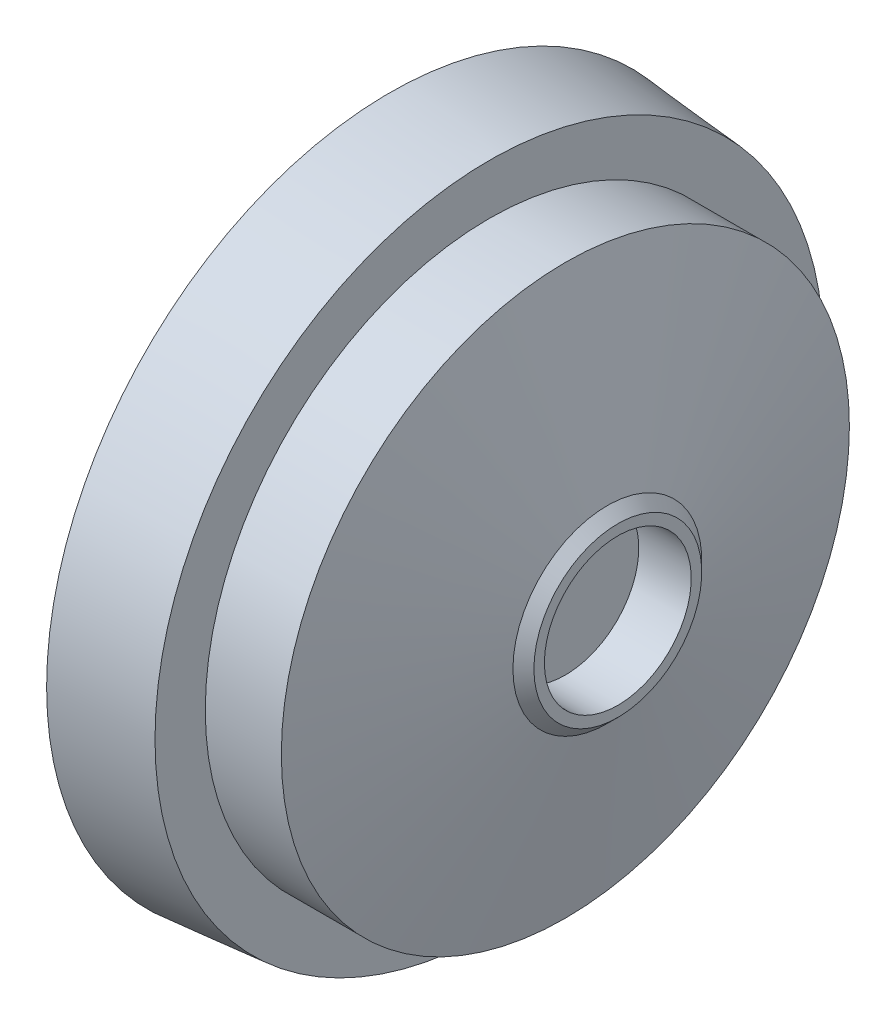
ISO-10303-21;
HEADER;
FILE_DESCRIPTION(('STEP AP214'),'2;1');
FILE_NAME('part.step','',(''),(''),'','','');
FILE_SCHEMA(('AUTOMOTIVE_DESIGN { 1 0 10303 214 1 1 1 1 }'));
ENDSEC;
DATA;
#1=APPLICATION_CONTEXT('core data for automotive mechanical design processes');
#2=APPLICATION_PROTOCOL_DEFINITION('international standard','automotive_design',2000,#1);
#3=PRODUCT_CONTEXT('',#1,'mechanical');
#4=PRODUCT('Part','Part','',(#3));
#5=PRODUCT_RELATED_PRODUCT_CATEGORY('part','',(#4));
#6=PRODUCT_DEFINITION_FORMATION('','',#4);
#7=PRODUCT_DEFINITION_CONTEXT('part definition',#1,'design');
#8=PRODUCT_DEFINITION('design','',#6,#7);
#9=PRODUCT_DEFINITION_SHAPE('','',#8);
#10=(LENGTH_UNIT() NAMED_UNIT(*) SI_UNIT(.MILLI.,.METRE.));
#11=(NAMED_UNIT(*) PLANE_ANGLE_UNIT() SI_UNIT($,.RADIAN.));
#12=(NAMED_UNIT(*) SI_UNIT($,.STERADIAN.) SOLID_ANGLE_UNIT());
#13=UNCERTAINTY_MEASURE_WITH_UNIT(LENGTH_MEASURE(1.E-05),#10,'distance_accuracy_value','');
#14=(GEOMETRIC_REPRESENTATION_CONTEXT(3) GLOBAL_UNCERTAINTY_ASSIGNED_CONTEXT((#13)) GLOBAL_UNIT_ASSIGNED_CONTEXT((#10,
#11,#12)) REPRESENTATION_CONTEXT('',''));
#15=CARTESIAN_POINT('',(0.,0.,0.));
#16=DIRECTION('',(0.,0.,1.));
#17=DIRECTION('',(1.,0.,0.));
#18=AXIS2_PLACEMENT_3D('',#15,#16,#17);
#19=CARTESIAN_POINT('',(-1.6,0.,0.));
#20=DIRECTION('',(1.,0.,0.));
#21=DIRECTION('',(0.,0.,-1.));
#22=AXIS2_PLACEMENT_3D('',#19,#20,#21);
#23=PLANE('',#22);
#24=CARTESIAN_POINT('',(-1.6,0.,0.));
#25=DIRECTION('',(1.,0.,0.));
#26=DIRECTION('',(0.,0.,-1.));
#27=AXIS2_PLACEMENT_3D('',#24,#25,#26);
#28=CIRCLE('',#27,50.6);
#29=CARTESIAN_POINT('',(-1.6,0.,-50.6));
#30=VERTEX_POINT('',#29);
#31=EDGE_CURVE('E39',#30,#30,#28,.F.);
#32=ORIENTED_EDGE('',*,*,#31,.T.);
#33=EDGE_LOOP('',(#32));
#34=FACE_BOUND('',#33,.T.);
#35=ADVANCED_FACE('F32',(#34),#23,.F.);
#36=CARTESIAN_POINT('',(0.,0.,0.));
#37=DIRECTION('',(-1.,0.,0.));
#38=DIRECTION('',(0.,0.,1.));
#39=AXIS2_PLACEMENT_3D('',#36,#37,#38);
#40=CYLINDRICAL_SURFACE('',#39,53.6);
#41=CARTESIAN_POINT('',(1.4,0.,0.));
#42=DIRECTION('',(1.,0.,0.));
#43=DIRECTION('',(0.,0.,-1.));
#44=AXIS2_PLACEMENT_3D('',#41,#42,#43);
#45=CIRCLE('',#44,53.6);
#46=CARTESIAN_POINT('',(1.4,0.,-53.6));
#47=VERTEX_POINT('',#46);
#48=EDGE_CURVE('E10',#47,#47,#45,.T.);
#49=ORIENTED_EDGE('',*,*,#48,.T.);
#50=EDGE_LOOP('',(#49));
#51=FACE_BOUND('',#50,.T.);
#52=CARTESIAN_POINT('',(10.4,0.,0.));
#53=DIRECTION('',(-1.,0.,0.));
#54=DIRECTION('',(0.,0.,1.));
#55=AXIS2_PLACEMENT_3D('',#52,#53,#54);
#56=CIRCLE('',#55,53.6);
#57=CARTESIAN_POINT('',(10.4,0.,53.6));
#58=VERTEX_POINT('',#57);
#59=EDGE_CURVE('E43',#58,#58,#56,.T.);
#60=ORIENTED_EDGE('',*,*,#59,.T.);
#61=EDGE_LOOP('',(#60));
#62=FACE_BOUND('',#61,.T.);
#63=ADVANCED_FACE('F94',(#51,#62),#40,.T.);
#64=CARTESIAN_POINT('',(10.4,53.6,0.));
#65=DIRECTION('',(1.,0.,0.));
#66=DIRECTION('',(0.,0.,-1.));
#67=AXIS2_PLACEMENT_3D('',#64,#65,#66);
#68=PLANE('',#67);
#69=ORIENTED_EDGE('',*,*,#59,.F.);
#70=EDGE_LOOP('',(#69));
#71=FACE_BOUND('',#70,.T.);
#72=CARTESIAN_POINT('',(10.4,0.,0.));
#73=DIRECTION('',(-1.,0.,0.));
#74=DIRECTION('',(0.,0.,1.));
#75=AXIS2_PLACEMENT_3D('',#72,#73,#74);
#76=CIRCLE('',#75,60.9);
#77=CARTESIAN_POINT('',(10.4,0.,60.9));
#78=VERTEX_POINT('',#77);
#79=EDGE_CURVE('E47',#78,#78,#76,.T.);
#80=ORIENTED_EDGE('',*,*,#79,.T.);
#81=EDGE_LOOP('',(#80));
#82=FACE_BOUND('',#81,.T.);
#83=ADVANCED_FACE('F98',(#71,#82),#68,.F.);
#84=CARTESIAN_POINT('',(0.,0.,0.));
#85=DIRECTION('',(-1.,0.,0.));
#86=DIRECTION('',(0.,0.,1.));
#87=AXIS2_PLACEMENT_3D('',#84,#85,#86);
#88=CYLINDRICAL_SURFACE('',#87,60.9);
#89=ORIENTED_EDGE('',*,*,#79,.F.);
#90=EDGE_LOOP('',(#89));
#91=FACE_BOUND('',#90,.T.);
#92=CARTESIAN_POINT('',(0.,0.,0.));
#93=DIRECTION('',(-1.,0.,0.));
#94=DIRECTION('',(0.,0.,1.));
#95=AXIS2_PLACEMENT_3D('',#92,#93,#94);
#96=CIRCLE('',#95,60.9);
#97=CARTESIAN_POINT('',(0.,0.,60.9));
#98=VERTEX_POINT('',#97);
#99=EDGE_CURVE('E52',#98,#98,#96,.T.);
#100=ORIENTED_EDGE('',*,*,#99,.T.);
#101=EDGE_LOOP('',(#100));
#102=FACE_BOUND('',#101,.T.);
#103=ADVANCED_FACE('F103',(#91,#102),#88,.F.);
#104=CARTESIAN_POINT('',(0.,60.9,0.));
#105=DIRECTION('',(1.,0.,0.));
#106=DIRECTION('',(0.,0.,-1.));
#107=AXIS2_PLACEMENT_3D('',#104,#105,#106);
#108=PLANE('',#107);
#109=ORIENTED_EDGE('',*,*,#99,.F.);
#110=EDGE_LOOP('',(#109));
#111=FACE_BOUND('',#110,.T.);
#112=CARTESIAN_POINT('',(0.,0.,0.));
#113=DIRECTION('',(-1.,0.,0.));
#114=DIRECTION('',(0.,0.,1.));
#115=AXIS2_PLACEMENT_3D('',#112,#113,#114);
#116=CIRCLE('',#115,65.4);
#117=CARTESIAN_POINT('',(0.,0.,65.4));
#118=VERTEX_POINT('',#117);
#119=EDGE_CURVE('E55',#118,#118,#116,.T.);
#120=ORIENTED_EDGE('',*,*,#119,.T.);
#121=EDGE_LOOP('',(#120));
#122=FACE_BOUND('',#121,.T.);
#123=ADVANCED_FACE('F107',(#111,#122),#108,.F.);
#124=CARTESIAN_POINT('',(19.,0.,0.));
#125=DIRECTION('',(-1.,0.,0.));
#126=DIRECTION('',(0.,0.,1.));
#127=AXIS2_PLACEMENT_3D('',#124,#125,#126);
#128=CONICAL_SURFACE('',#127,63.7377153930075,0.0872664625997127);
#129=ORIENTED_EDGE('',*,*,#119,.F.);
#130=EDGE_LOOP('',(#129));
#131=FACE_BOUND('',#130,.T.);
#132=CARTESIAN_POINT('',(19.,0.,0.));
#133=DIRECTION('',(-1.,0.,0.));
#134=DIRECTION('',(0.,0.,1.));
#135=AXIS2_PLACEMENT_3D('',#132,#133,#134);
#136=CIRCLE('',#135,63.7377153930075);
#137=CARTESIAN_POINT('',(19.,0.,63.7377153930075));
#138=VERTEX_POINT('',#137);
#139=EDGE_CURVE('E58',#138,#138,#136,.T.);
#140=ORIENTED_EDGE('',*,*,#139,.T.);
#141=EDGE_LOOP('',(#140));
#142=FACE_BOUND('',#141,.T.);
#143=ADVANCED_FACE('F111',(#131,#142),#128,.T.);
#144=CARTESIAN_POINT('',(19.,63.7377153930075,0.));
#145=DIRECTION('',(-1.,0.,0.));
#146=DIRECTION('',(0.,0.,1.));
#147=AXIS2_PLACEMENT_3D('',#144,#145,#146);
#148=PLANE('',#147);
#149=ORIENTED_EDGE('',*,*,#139,.F.);
#150=EDGE_LOOP('',(#149));
#151=FACE_BOUND('',#150,.T.);
#152=CARTESIAN_POINT('',(19.,0.,0.));
#153=DIRECTION('',(-1.,0.,0.));
#154=DIRECTION('',(0.,0.,1.));
#155=AXIS2_PLACEMENT_3D('',#152,#153,#154);
#156=CIRCLE('',#155,54.15);
#157=CARTESIAN_POINT('',(19.,0.,54.15));
#158=VERTEX_POINT('',#157);
#159=EDGE_CURVE('E61',#158,#158,#156,.T.);
#160=ORIENTED_EDGE('',*,*,#159,.T.);
#161=EDGE_LOOP('',(#160));
#162=FACE_BOUND('',#161,.T.);
#163=ADVANCED_FACE('F115',(#151,#162),#148,.F.);
#164=CARTESIAN_POINT('',(0.,0.,0.));
#165=DIRECTION('',(-1.,0.,0.));
#166=DIRECTION('',(0.,0.,1.));
#167=AXIS2_PLACEMENT_3D('',#164,#165,#166);
#168=CYLINDRICAL_SURFACE('',#167,54.15);
#169=ORIENTED_EDGE('',*,*,#159,.F.);
#170=EDGE_LOOP('',(#169));
#171=FACE_BOUND('',#170,.T.);
#172=CARTESIAN_POINT('',(33.5,0.,0.));
#173=DIRECTION('',(-1.,0.,0.));
#174=DIRECTION('',(0.,0.,1.));
#175=AXIS2_PLACEMENT_3D('',#172,#173,#174);
#176=CIRCLE('',#175,54.15);
#177=CARTESIAN_POINT('',(33.5,0.,54.15));
#178=VERTEX_POINT('',#177);
#179=EDGE_CURVE('E64',#178,#178,#176,.T.);
#180=ORIENTED_EDGE('',*,*,#179,.T.);
#181=EDGE_LOOP('',(#180));
#182=FACE_BOUND('',#181,.T.);
#183=ADVANCED_FACE('F119',(#171,#182),#168,.T.);
#184=CARTESIAN_POINT('',(41.5000000000004,0.,0.));
#185=DIRECTION('',(-1.,0.,0.));
#186=DIRECTION('',(0.,0.,1.));
#187=AXIS2_PLACEMENT_3D('',#184,#185,#186);
#188=CONICAL_SURFACE('',#187,18.0000000000004,1.35300624403141);
#189=ORIENTED_EDGE('',*,*,#179,.F.);
#190=EDGE_LOOP('',(#189));
#191=FACE_BOUND('',#190,.T.);
#192=CARTESIAN_POINT('',(41.5000000000004,0.,0.));
#193=DIRECTION('',(-1.,0.,0.));
#194=DIRECTION('',(0.,0.,1.));
#195=AXIS2_PLACEMENT_3D('',#192,#193,#194);
#196=CIRCLE('',#195,18.0000000000004);
#197=CARTESIAN_POINT('',(41.5000000000004,0.,18.0000000000004));
#198=VERTEX_POINT('',#197);
#199=EDGE_CURVE('E67',#198,#198,#196,.T.);
#200=ORIENTED_EDGE('',*,*,#199,.T.);
#201=EDGE_LOOP('',(#200));
#202=FACE_BOUND('',#201,.T.);
#203=ADVANCED_FACE('F123',(#191,#202),#188,.T.);
#204=CARTESIAN_POINT('',(43.5000000000001,0.,0.));
#205=DIRECTION('',(-1.,0.,0.));
#206=DIRECTION('',(0.,0.,1.));
#207=AXIS2_PLACEMENT_3D('',#204,#205,#206);
#208=CONICAL_SURFACE('',#207,16.,0.78539816339763);
#209=ORIENTED_EDGE('',*,*,#199,.F.);
#210=EDGE_LOOP('',(#209));
#211=FACE_BOUND('',#210,.T.);
#212=CARTESIAN_POINT('',(43.5000000000001,0.,0.));
#213=DIRECTION('',(-1.,0.,0.));
#214=DIRECTION('',(0.,0.,1.));
#215=AXIS2_PLACEMENT_3D('',#212,#213,#214);
#216=CIRCLE('',#215,16.);
#217=CARTESIAN_POINT('',(43.5000000000001,0.,16.));
#218=VERTEX_POINT('',#217);
#219=EDGE_CURVE('E70',#218,#218,#216,.T.);
#220=ORIENTED_EDGE('',*,*,#219,.T.);
#221=EDGE_LOOP('',(#220));
#222=FACE_BOUND('',#221,.T.);
#223=ADVANCED_FACE('F127',(#211,#222),#208,.T.);
#224=CARTESIAN_POINT('',(43.5000000000001,16.,0.));
#225=DIRECTION('',(-1.,0.,0.));
#226=DIRECTION('',(0.,0.,1.));
#227=AXIS2_PLACEMENT_3D('',#224,#225,#226);
#228=PLANE('',#227);
#229=ORIENTED_EDGE('',*,*,#219,.F.);
#230=EDGE_LOOP('',(#229));
#231=FACE_BOUND('',#230,.T.);
#232=CARTESIAN_POINT('',(43.5000000000001,0.,0.));
#233=DIRECTION('',(-1.,0.,0.));
#234=DIRECTION('',(0.,0.,1.));
#235=AXIS2_PLACEMENT_3D('',#232,#233,#234);
#236=CIRCLE('',#235,14.);
#237=CARTESIAN_POINT('',(43.5000000000001,0.,14.));
#238=VERTEX_POINT('',#237);
#239=EDGE_CURVE('E73',#238,#238,#236,.T.);
#240=ORIENTED_EDGE('',*,*,#239,.T.);
#241=EDGE_LOOP('',(#240));
#242=FACE_BOUND('',#241,.T.);
#243=ADVANCED_FACE('F90',(#231,#242),#228,.F.);
#244=CARTESIAN_POINT('',(0.,0.,0.));
#245=DIRECTION('',(-1.,0.,0.));
#246=DIRECTION('',(0.,0.,1.));
#247=AXIS2_PLACEMENT_3D('',#244,#245,#246);
#248=CYLINDRICAL_SURFACE('',#247,14.);
#249=ORIENTED_EDGE('',*,*,#239,.F.);
#250=EDGE_LOOP('',(#249));
#251=FACE_BOUND('',#250,.T.);
#252=CARTESIAN_POINT('',(33.5000000000004,0.,0.));
#253=DIRECTION('',(-1.,0.,0.));
#254=DIRECTION('',(0.,0.,1.));
#255=AXIS2_PLACEMENT_3D('',#252,#253,#254);
#256=CIRCLE('',#255,14.);
#257=CARTESIAN_POINT('',(33.5000000000004,0.,14.));
#258=VERTEX_POINT('',#257);
#259=EDGE_CURVE('E76',#258,#258,#256,.T.);
#260=ORIENTED_EDGE('',*,*,#259,.T.);
#261=EDGE_LOOP('',(#260));
#262=FACE_BOUND('',#261,.T.);
#263=ADVANCED_FACE('F80',(#251,#262),#248,.F.);
#264=CARTESIAN_POINT('',(33.5000000000004,14.,0.));
#265=DIRECTION('',(-1.,0.,0.));
#266=DIRECTION('',(0.,0.,1.));
#267=AXIS2_PLACEMENT_3D('',#264,#265,#266);
#268=PLANE('',#267);
#269=ORIENTED_EDGE('',*,*,#259,.F.);
#270=EDGE_LOOP('',(#269));
#271=FACE_BOUND('',#270,.T.);
#272=ADVANCED_FACE('F82',(#271),#268,.F.);
#273=CARTESIAN_POINT('',(1.4,0.,0.));
#274=DIRECTION('',(1.,0.,0.));
#275=DIRECTION('',(0.,0.,-1.));
#276=AXIS2_PLACEMENT_3D('',#273,#274,#275);
#277=TOROIDAL_SURFACE('',#276,50.6,3.);
#278=ORIENTED_EDGE('',*,*,#48,.F.);
#279=EDGE_LOOP('',(#278));
#280=FACE_BOUND('',#279,.T.);
#281=ORIENTED_EDGE('',*,*,#31,.F.);
#282=EDGE_LOOP('',(#281));
#283=FACE_BOUND('',#282,.T.);
#284=ADVANCED_FACE('F34',(#280,#283),#277,.T.);
#285=CLOSED_SHELL('',(#35,#63,#83,#103,#123,#143,#163,#183,#203,#223,#243,#263,#272,#284));
#286=MANIFOLD_SOLID_BREP('B2',#285);
#287=ADVANCED_BREP_SHAPE_REPRESENTATION('',(#18,#286),#14);
#288=SHAPE_DEFINITION_REPRESENTATION(#9,#287);
ENDSEC;
END-ISO-10303-21;
